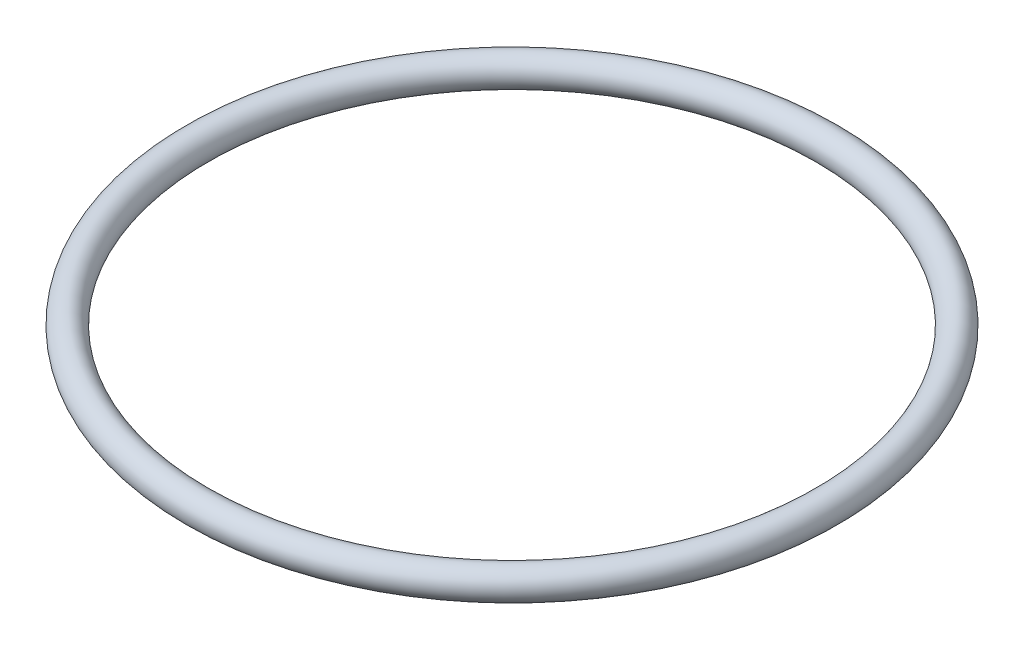
ISO-10303-21;
HEADER;
FILE_DESCRIPTION(('STEP AP214'),'2;1');
FILE_NAME('part.step','',(''),(''),'','','');
FILE_SCHEMA(('AUTOMOTIVE_DESIGN { 1 0 10303 214 1 1 1 1 }'));
ENDSEC;
DATA;
#1=APPLICATION_CONTEXT('core data for automotive mechanical design processes');
#2=APPLICATION_PROTOCOL_DEFINITION('international standard','automotive_design',2000,#1);
#3=PRODUCT_CONTEXT('',#1,'mechanical');
#4=PRODUCT('Part','Part','',(#3));
#5=PRODUCT_RELATED_PRODUCT_CATEGORY('part','',(#4));
#6=PRODUCT_DEFINITION_FORMATION('','',#4);
#7=PRODUCT_DEFINITION_CONTEXT('part definition',#1,'design');
#8=PRODUCT_DEFINITION('design','',#6,#7);
#9=PRODUCT_DEFINITION_SHAPE('','',#8);
#10=(LENGTH_UNIT() NAMED_UNIT(*) SI_UNIT(.MILLI.,.METRE.));
#11=(NAMED_UNIT(*) PLANE_ANGLE_UNIT() SI_UNIT($,.RADIAN.));
#12=(NAMED_UNIT(*) SI_UNIT($,.STERADIAN.) SOLID_ANGLE_UNIT());
#13=UNCERTAINTY_MEASURE_WITH_UNIT(LENGTH_MEASURE(1.E-05),#10,'distance_accuracy_value','');
#14=(GEOMETRIC_REPRESENTATION_CONTEXT(3) GLOBAL_UNCERTAINTY_ASSIGNED_CONTEXT((#13)) GLOBAL_UNIT_ASSIGNED_CONTEXT((#10,
#11,#12)) REPRESENTATION_CONTEXT('',''));
#15=CARTESIAN_POINT('',(0.,0.,0.));
#16=DIRECTION('',(0.,0.,1.));
#17=DIRECTION('',(1.,0.,0.));
#18=AXIS2_PLACEMENT_3D('',#15,#16,#17);
#19=CARTESIAN_POINT('',(0.,0.,0.));
#20=DIRECTION('',(0.,-1.,0.));
#21=DIRECTION('',(0.,0.,-1.));
#22=AXIS2_PLACEMENT_3D('',#19,#20,#21);
#23=TOROIDAL_SURFACE('',#22,23.8715,1.143);
#24=CARTESIAN_POINT('',(0.,0.,-25.0145));
#25=VERTEX_POINT('',#24);
#26=VERTEX_LOOP('',#25);
#27=FACE_BOUND('',#26,.T.);
#28=ADVANCED_FACE('F28',(#27),#23,.T.);
#29=CLOSED_SHELL('',(#28));
#30=MANIFOLD_SOLID_BREP('B2',#29);
#31=ADVANCED_BREP_SHAPE_REPRESENTATION('',(#18,#30),#14);
#32=SHAPE_DEFINITION_REPRESENTATION(#9,#31);
ENDSEC;
END-ISO-10303-21;
